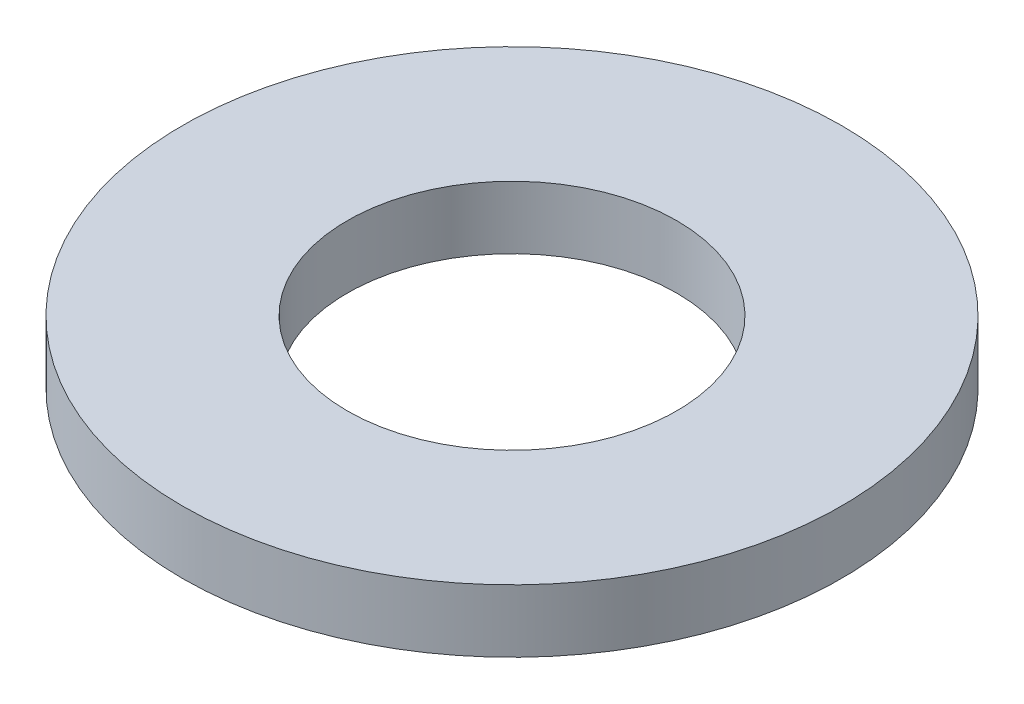
ISO-10303-21;
HEADER;
FILE_DESCRIPTION(('STEP AP214'),'2;1');
FILE_NAME('part.step','',(''),(''),'','','');
FILE_SCHEMA(('AUTOMOTIVE_DESIGN { 1 0 10303 214 1 1 1 1 }'));
ENDSEC;
DATA;
#1=APPLICATION_CONTEXT('core data for automotive mechanical design processes');
#2=APPLICATION_PROTOCOL_DEFINITION('international standard','automotive_design',2000,#1);
#3=PRODUCT_CONTEXT('',#1,'mechanical');
#4=PRODUCT('Part','Part','',(#3));
#5=PRODUCT_RELATED_PRODUCT_CATEGORY('part','',(#4));
#6=PRODUCT_DEFINITION_FORMATION('','',#4);
#7=PRODUCT_DEFINITION_CONTEXT('part definition',#1,'design');
#8=PRODUCT_DEFINITION('design','',#6,#7);
#9=PRODUCT_DEFINITION_SHAPE('','',#8);
#10=(LENGTH_UNIT() NAMED_UNIT(*) SI_UNIT(.MILLI.,.METRE.));
#11=(NAMED_UNIT(*) PLANE_ANGLE_UNIT() SI_UNIT($,.RADIAN.));
#12=(NAMED_UNIT(*) SI_UNIT($,.STERADIAN.) SOLID_ANGLE_UNIT());
#13=UNCERTAINTY_MEASURE_WITH_UNIT(LENGTH_MEASURE(1.E-05),#10,'distance_accuracy_value','');
#14=(GEOMETRIC_REPRESENTATION_CONTEXT(3) GLOBAL_UNCERTAINTY_ASSIGNED_CONTEXT((#13)) GLOBAL_UNIT_ASSIGNED_CONTEXT((#10,
#11,#12)) REPRESENTATION_CONTEXT('',''));
#15=CARTESIAN_POINT('',(0.,0.,0.));
#16=DIRECTION('',(0.,0.,1.));
#17=DIRECTION('',(1.,0.,0.));
#18=AXIS2_PLACEMENT_3D('',#15,#16,#17);
#19=CARTESIAN_POINT('',(0.,2.,0.));
#20=DIRECTION('',(0.,1.,0.));
#21=DIRECTION('',(0.,0.,1.));
#22=AXIS2_PLACEMENT_3D('',#19,#20,#21);
#23=PLANE('',#22);
#24=CARTESIAN_POINT('',(0.,2.,0.));
#25=DIRECTION('',(0.,1.,0.));
#26=DIRECTION('',(0.,0.,1.));
#27=AXIS2_PLACEMENT_3D('',#24,#25,#26);
#28=CIRCLE('',#27,10.5);
#29=CARTESIAN_POINT('',(0.,2.,10.5));
#30=VERTEX_POINT('',#29);
#31=EDGE_CURVE('E10',#30,#30,#28,.T.);
#32=ORIENTED_EDGE('',*,*,#31,.T.);
#33=EDGE_LOOP('',(#32));
#34=FACE_BOUND('',#33,.T.);
#35=CARTESIAN_POINT('',(0.,2.,0.));
#36=DIRECTION('',(0.,1.,0.));
#37=DIRECTION('',(0.,0.,1.));
#38=AXIS2_PLACEMENT_3D('',#35,#36,#37);
#39=CIRCLE('',#38,5.25);
#40=CARTESIAN_POINT('',(0.,2.,5.25));
#41=VERTEX_POINT('',#40);
#42=EDGE_CURVE('E43',#41,#41,#39,.T.);
#43=ORIENTED_EDGE('',*,*,#42,.F.);
#44=EDGE_LOOP('',(#43));
#45=FACE_BOUND('',#44,.T.);
#46=ADVANCED_FACE('F32',(#34,#45),#23,.T.);
#47=CARTESIAN_POINT('',(0.,0.,0.));
#48=DIRECTION('',(0.,1.,0.));
#49=DIRECTION('',(0.,0.,1.));
#50=AXIS2_PLACEMENT_3D('',#47,#48,#49);
#51=PLANE('',#50);
#52=CARTESIAN_POINT('',(0.,0.,0.));
#53=DIRECTION('',(0.,1.,0.));
#54=DIRECTION('',(0.,0.,1.));
#55=AXIS2_PLACEMENT_3D('',#52,#53,#54);
#56=CIRCLE('',#55,10.5);
#57=CARTESIAN_POINT('',(0.,0.,10.5));
#58=VERTEX_POINT('',#57);
#59=EDGE_CURVE('E36',#58,#58,#56,.T.);
#60=ORIENTED_EDGE('',*,*,#59,.F.);
#61=EDGE_LOOP('',(#60));
#62=FACE_BOUND('',#61,.T.);
#63=CARTESIAN_POINT('',(0.,0.,0.));
#64=DIRECTION('',(0.,1.,0.));
#65=DIRECTION('',(0.,0.,1.));
#66=AXIS2_PLACEMENT_3D('',#63,#64,#65);
#67=CIRCLE('',#66,5.25);
#68=CARTESIAN_POINT('',(0.,0.,5.25));
#69=VERTEX_POINT('',#68);
#70=EDGE_CURVE('E45',#69,#69,#67,.T.);
#71=ORIENTED_EDGE('',*,*,#70,.T.);
#72=EDGE_LOOP('',(#71));
#73=FACE_BOUND('',#72,.T.);
#74=ADVANCED_FACE('F55',(#62,#73),#51,.F.);
#75=CARTESIAN_POINT('',(0.,2.,0.));
#76=DIRECTION('',(0.,-1.,0.));
#77=DIRECTION('',(0.,0.,-1.));
#78=AXIS2_PLACEMENT_3D('',#75,#76,#77);
#79=CYLINDRICAL_SURFACE('',#78,10.5);
#80=ORIENTED_EDGE('',*,*,#31,.F.);
#81=EDGE_LOOP('',(#80));
#82=FACE_BOUND('',#81,.T.);
#83=ORIENTED_EDGE('',*,*,#59,.T.);
#84=EDGE_LOOP('',(#83));
#85=FACE_BOUND('',#84,.T.);
#86=ADVANCED_FACE('F34',(#82,#85),#79,.T.);
#87=CARTESIAN_POINT('',(0.,2.,0.));
#88=DIRECTION('',(0.,-1.,0.));
#89=DIRECTION('',(0.,0.,-1.));
#90=AXIS2_PLACEMENT_3D('',#87,#88,#89);
#91=CYLINDRICAL_SURFACE('',#90,5.25);
#92=ORIENTED_EDGE('',*,*,#42,.T.);
#93=EDGE_LOOP('',(#92));
#94=FACE_BOUND('',#93,.T.);
#95=ORIENTED_EDGE('',*,*,#70,.F.);
#96=EDGE_LOOP('',(#95));
#97=FACE_BOUND('',#96,.T.);
#98=ADVANCED_FACE('F51',(#94,#97),#91,.F.);
#99=CLOSED_SHELL('',(#46,#74,#86,#98));
#100=MANIFOLD_SOLID_BREP('B2',#99);
#101=ADVANCED_BREP_SHAPE_REPRESENTATION('',(#18,#100),#14);
#102=SHAPE_DEFINITION_REPRESENTATION(#9,#101);
ENDSEC;
END-ISO-10303-21;
